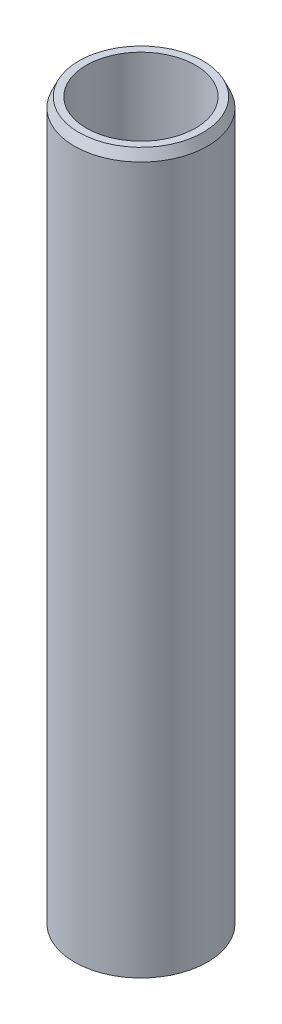
ISO-10303-21;
HEADER;
FILE_DESCRIPTION(('STEP AP214'),'2;1');
FILE_NAME('part.step','',(''),(''),'','','');
FILE_SCHEMA(('AUTOMOTIVE_DESIGN { 1 0 10303 214 1 1 1 1 }'));
ENDSEC;
DATA;
#1=APPLICATION_CONTEXT('core data for automotive mechanical design processes');
#2=APPLICATION_PROTOCOL_DEFINITION('international standard','automotive_design',2000,#1);
#3=PRODUCT_CONTEXT('',#1,'mechanical');
#4=PRODUCT('Part','Part','',(#3));
#5=PRODUCT_RELATED_PRODUCT_CATEGORY('part','',(#4));
#6=PRODUCT_DEFINITION_FORMATION('','',#4);
#7=PRODUCT_DEFINITION_CONTEXT('part definition',#1,'design');
#8=PRODUCT_DEFINITION('design','',#6,#7);
#9=PRODUCT_DEFINITION_SHAPE('','',#8);
#10=(LENGTH_UNIT() NAMED_UNIT(*) SI_UNIT(.MILLI.,.METRE.));
#11=(NAMED_UNIT(*) PLANE_ANGLE_UNIT() SI_UNIT($,.RADIAN.));
#12=(NAMED_UNIT(*) SI_UNIT($,.STERADIAN.) SOLID_ANGLE_UNIT());
#13=UNCERTAINTY_MEASURE_WITH_UNIT(LENGTH_MEASURE(1.E-05),#10,'distance_accuracy_value','');
#14=(GEOMETRIC_REPRESENTATION_CONTEXT(3) GLOBAL_UNCERTAINTY_ASSIGNED_CONTEXT((#13)) GLOBAL_UNIT_ASSIGNED_CONTEXT((#10,
#11,#12)) REPRESENTATION_CONTEXT('',''));
#15=CARTESIAN_POINT('',(0.,0.,0.));
#16=DIRECTION('',(0.,0.,1.));
#17=DIRECTION('',(1.,0.,0.));
#18=AXIS2_PLACEMENT_3D('',#15,#16,#17);
#19=CARTESIAN_POINT('',(0.,379.182196114133,0.));
#20=DIRECTION('',(0.,-1.,0.));
#21=DIRECTION('',(0.,0.,-1.));
#22=AXIS2_PLACEMENT_3D('',#19,#20,#21);
#23=CYLINDRICAL_SURFACE('',#22,35.);
#24=CARTESIAN_POINT('',(0.,374.100567586076,0.));
#25=DIRECTION('',(0.,1.,0.));
#26=DIRECTION('',(0.,0.,1.));
#27=AXIS2_PLACEMENT_3D('',#24,#25,#26);
#28=CIRCLE('',#27,35.);
#29=CARTESIAN_POINT('',(0.,374.100567586076,35.));
#30=VERTEX_POINT('',#29);
#31=EDGE_CURVE('E50',#30,#30,#28,.F.);
#32=ORIENTED_EDGE('',*,*,#31,.T.);
#33=EDGE_LOOP('',(#32));
#34=FACE_BOUND('',#33,.T.);
#35=CARTESIAN_POINT('',(0.,2.34829889146521,0.));
#36=DIRECTION('',(0.,1.,0.));
#37=DIRECTION('',(0.,0.,1.));
#38=AXIS2_PLACEMENT_3D('',#35,#36,#37);
#39=CIRCLE('',#38,35.);
#40=CARTESIAN_POINT('',(0.,2.34829889146521,35.));
#41=VERTEX_POINT('',#40);
#42=EDGE_CURVE('E51',#41,#41,#39,.T.);
#43=ORIENTED_EDGE('',*,*,#42,.T.);
#44=EDGE_LOOP('',(#43));
#45=FACE_BOUND('',#44,.T.);
#46=ADVANCED_FACE('F39',(#34,#45),#23,.T.);
#47=CARTESIAN_POINT('',(0.,379.182196114133,0.));
#48=DIRECTION('',(0.,1.,0.));
#49=DIRECTION('',(0.,0.,1.));
#50=AXIS2_PLACEMENT_3D('',#47,#48,#49);
#51=PLANE('',#50);
#52=CARTESIAN_POINT('',(0.,379.182196114133,0.));
#53=DIRECTION('',(0.,1.,0.));
#54=DIRECTION('',(0.,0.,1.));
#55=AXIS2_PLACEMENT_3D('',#52,#53,#54);
#56=CIRCLE('',#55,32.6517011085348);
#57=CARTESIAN_POINT('',(0.,379.182196114133,32.6517011085348));
#58=VERTEX_POINT('',#57);
#59=EDGE_CURVE('E54',#58,#58,#56,.T.);
#60=ORIENTED_EDGE('',*,*,#59,.T.);
#61=EDGE_LOOP('',(#60));
#62=FACE_BOUND('',#61,.T.);
#63=CARTESIAN_POINT('',(0.,379.182196114133,0.));
#64=DIRECTION('',(0.,1.,0.));
#65=DIRECTION('',(0.,0.,1.));
#66=AXIS2_PLACEMENT_3D('',#63,#64,#65);
#67=CIRCLE('',#66,28.7178834576716);
#68=CARTESIAN_POINT('',(0.,379.182196114133,28.7178834576716));
#69=VERTEX_POINT('',#68);
#70=EDGE_CURVE('E58',#69,#69,#67,.T.);
#71=ORIENTED_EDGE('',*,*,#70,.F.);
#72=EDGE_LOOP('',(#71));
#73=FACE_BOUND('',#72,.T.);
#74=ADVANCED_FACE('F69',(#62,#73),#51,.T.);
#75=CARTESIAN_POINT('',(0.,0.,0.));
#76=DIRECTION('',(0.,1.,0.));
#77=DIRECTION('',(0.,0.,1.));
#78=AXIS2_PLACEMENT_3D('',#75,#76,#77);
#79=PLANE('',#78);
#80=CARTESIAN_POINT('',(0.,0.,0.));
#81=DIRECTION('',(0.,1.,0.));
#82=DIRECTION('',(0.,0.,1.));
#83=AXIS2_PLACEMENT_3D('',#80,#81,#82);
#84=CIRCLE('',#83,29.9183714719438);
#85=CARTESIAN_POINT('',(0.,0.,29.9183714719438));
#86=VERTEX_POINT('',#85);
#87=EDGE_CURVE('E10',#86,#86,#84,.F.);
#88=ORIENTED_EDGE('',*,*,#87,.T.);
#89=EDGE_LOOP('',(#88));
#90=FACE_BOUND('',#89,.T.);
#91=CARTESIAN_POINT('',(0.,0.,0.));
#92=DIRECTION('',(0.,1.,0.));
#93=DIRECTION('',(0.,0.,1.));
#94=AXIS2_PLACEMENT_3D('',#91,#92,#93);
#95=CIRCLE('',#94,28.7178834576716);
#96=CARTESIAN_POINT('',(0.,0.,28.7178834576716));
#97=VERTEX_POINT('',#96);
#98=EDGE_CURVE('E63',#97,#97,#95,.T.);
#99=ORIENTED_EDGE('',*,*,#98,.T.);
#100=EDGE_LOOP('',(#99));
#101=FACE_BOUND('',#100,.T.);
#102=ADVANCED_FACE('F75',(#90,#101),#79,.F.);
#103=CARTESIAN_POINT('',(0.,379.182196114133,0.));
#104=DIRECTION('',(0.,-1.,0.));
#105=DIRECTION('',(0.,0.,-1.));
#106=AXIS2_PLACEMENT_3D('',#103,#104,#105);
#107=CYLINDRICAL_SURFACE('',#106,28.7178834576716);
#108=ORIENTED_EDGE('',*,*,#70,.T.);
#109=EDGE_LOOP('',(#108));
#110=FACE_BOUND('',#109,.T.);
#111=ORIENTED_EDGE('',*,*,#98,.F.);
#112=EDGE_LOOP('',(#111));
#113=FACE_BOUND('',#112,.T.);
#114=ADVANCED_FACE('F70',(#110,#113),#107,.F.);
#115=CARTESIAN_POINT('',(0.,379.182196114133,0.));
#116=DIRECTION('',(0.,-1.,0.));
#117=DIRECTION('',(0.,0.,-1.));
#118=AXIS2_PLACEMENT_3D('',#115,#116,#117);
#119=CONICAL_SURFACE('',#118,32.6517011085348,0.432883308437932);
#120=ORIENTED_EDGE('',*,*,#31,.F.);
#121=EDGE_LOOP('',(#120));
#122=FACE_BOUND('',#121,.T.);
#123=ORIENTED_EDGE('',*,*,#59,.F.);
#124=EDGE_LOOP('',(#123));
#125=FACE_BOUND('',#124,.T.);
#126=ADVANCED_FACE('F81',(#122,#125),#119,.T.);
#127=CARTESIAN_POINT('',(0.,2.34829889146521,0.));
#128=DIRECTION('',(0.,1.,0.));
#129=DIRECTION('',(0.,0.,1.));
#130=AXIS2_PLACEMENT_3D('',#127,#128,#129);
#131=CONICAL_SURFACE('',#130,35.,1.13791301835696);
#132=ORIENTED_EDGE('',*,*,#87,.F.);
#133=EDGE_LOOP('',(#132));
#134=FACE_BOUND('',#133,.T.);
#135=ORIENTED_EDGE('',*,*,#42,.F.);
#136=EDGE_LOOP('',(#135));
#137=FACE_BOUND('',#136,.T.);
#138=ADVANCED_FACE('F45',(#134,#137),#131,.T.);
#139=CLOSED_SHELL('',(#46,#74,#102,#114,#126,#138));
#140=MANIFOLD_SOLID_BREP('B2',#139);
#141=ADVANCED_BREP_SHAPE_REPRESENTATION('',(#18,#140),#14);
#142=SHAPE_DEFINITION_REPRESENTATION(#9,#141);
ENDSEC;
END-ISO-10303-21;
